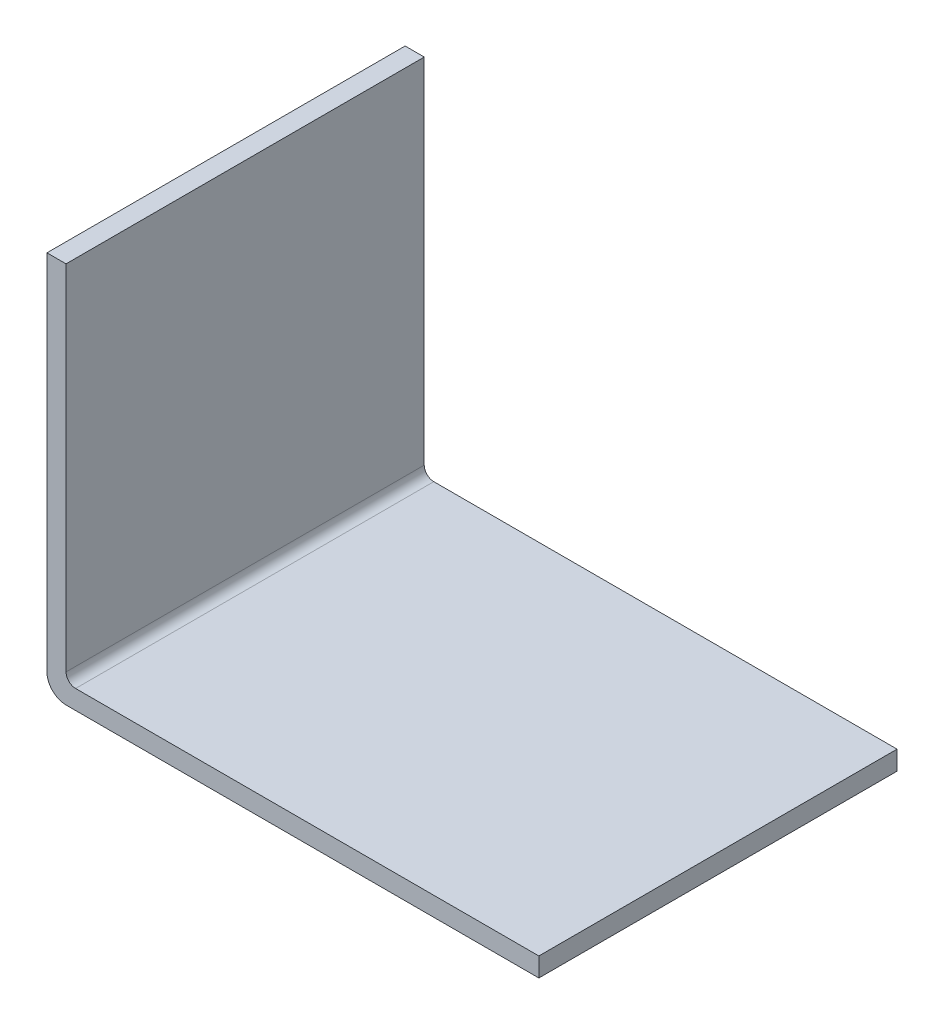
ISO-10303-21;
HEADER;
FILE_DESCRIPTION(('STEP AP214'),'2;1');
FILE_NAME('part.step','',(''),(''),'','','');
FILE_SCHEMA(('AUTOMOTIVE_DESIGN { 1 0 10303 214 1 1 1 1 }'));
ENDSEC;
DATA;
#1=APPLICATION_CONTEXT('core data for automotive mechanical design processes');
#2=APPLICATION_PROTOCOL_DEFINITION('international standard','automotive_design',2000,#1);
#3=PRODUCT_CONTEXT('',#1,'mechanical');
#4=PRODUCT('Part','Part','',(#3));
#5=PRODUCT_RELATED_PRODUCT_CATEGORY('part','',(#4));
#6=PRODUCT_DEFINITION_FORMATION('','',#4);
#7=PRODUCT_DEFINITION_CONTEXT('part definition',#1,'design');
#8=PRODUCT_DEFINITION('design','',#6,#7);
#9=PRODUCT_DEFINITION_SHAPE('','',#8);
#10=(LENGTH_UNIT() NAMED_UNIT(*) SI_UNIT(.MILLI.,.METRE.));
#11=(NAMED_UNIT(*) PLANE_ANGLE_UNIT() SI_UNIT($,.RADIAN.));
#12=(NAMED_UNIT(*) SI_UNIT($,.STERADIAN.) SOLID_ANGLE_UNIT());
#13=UNCERTAINTY_MEASURE_WITH_UNIT(LENGTH_MEASURE(1.E-05),#10,'distance_accuracy_value','');
#14=(GEOMETRIC_REPRESENTATION_CONTEXT(3) GLOBAL_UNCERTAINTY_ASSIGNED_CONTEXT((#13)) GLOBAL_UNIT_ASSIGNED_CONTEXT((#10,
#11,#12)) REPRESENTATION_CONTEXT('',''));
#15=CARTESIAN_POINT('',(0.,0.,0.));
#16=DIRECTION('',(0.,0.,1.));
#17=DIRECTION('',(1.,0.,0.));
#18=AXIS2_PLACEMENT_3D('',#15,#16,#17);
#19=CARTESIAN_POINT('',(25.75,40.,18.75));
#20=DIRECTION('',(-1.,0.,0.));
#21=DIRECTION('',(0.,0.,1.));
#22=AXIS2_PLACEMENT_3D('',#19,#20,#21);
#23=PLANE('',#22);
#24=DIRECTION('',(0.,-1.,0.));
#25=VECTOR('',#24,1.);
#26=CARTESIAN_POINT('',(25.75,40.,-18.75));
#27=LINE('',#26,#25);
#28=CARTESIAN_POINT('',(25.75,2.,-18.75));
#29=VERTEX_POINT('',#28);
#30=CARTESIAN_POINT('',(25.75,0.,-18.75));
#31=VERTEX_POINT('',#30);
#32=EDGE_CURVE('E101',#29,#31,#27,.T.);
#33=ORIENTED_EDGE('',*,*,#32,.F.);
#34=DIRECTION('',(0.,0.,1.));
#35=VECTOR('',#34,1.);
#36=CARTESIAN_POINT('',(25.75,2.,-18.75));
#37=LINE('',#36,#35);
#38=CARTESIAN_POINT('',(25.75,2.,18.75));
#39=VERTEX_POINT('',#38);
#40=EDGE_CURVE('E108',#29,#39,#37,.T.);
#41=ORIENTED_EDGE('',*,*,#40,.T.);
#42=DIRECTION('',(0.,-1.,0.));
#43=VECTOR('',#42,1.);
#44=CARTESIAN_POINT('',(25.75,40.,18.75));
#45=LINE('',#44,#43);
#46=CARTESIAN_POINT('',(25.75,0.,18.75));
#47=VERTEX_POINT('',#46);
#48=EDGE_CURVE('E153',#39,#47,#45,.T.);
#49=ORIENTED_EDGE('',*,*,#48,.T.);
#50=DIRECTION('',(0.,0.,-1.));
#51=VECTOR('',#50,1.);
#52=CARTESIAN_POINT('',(25.75,0.,18.75));
#53=LINE('',#52,#51);
#54=EDGE_CURVE('E122',#47,#31,#53,.T.);
#55=ORIENTED_EDGE('',*,*,#54,.T.);
#56=EDGE_LOOP('',(#33,#41,#49,#55));
#57=FACE_BOUND('',#56,.T.);
#58=ADVANCED_FACE('F34',(#57),#23,.F.);
#59=CARTESIAN_POINT('',(-25.75,40.,-18.75));
#60=DIRECTION('',(0.,0.,1.));
#61=DIRECTION('',(1.,0.,0.));
#62=AXIS2_PLACEMENT_3D('',#59,#60,#61);
#63=PLANE('',#62);
#64=DIRECTION('',(-1.,0.,0.));
#65=VECTOR('',#64,1.);
#66=CARTESIAN_POINT('',(-25.75,0.,-18.75));
#67=LINE('',#66,#65);
#68=CARTESIAN_POINT('',(-23.75,0.,-18.75));
#69=VERTEX_POINT('',#68);
#70=EDGE_CURVE('E159',#31,#69,#67,.T.);
#71=ORIENTED_EDGE('',*,*,#70,.T.);
#72=CARTESIAN_POINT('',(-23.75,2.,-18.75));
#73=DIRECTION('',(0.,0.,1.));
#74=DIRECTION('',(1.,0.,0.));
#75=AXIS2_PLACEMENT_3D('',#72,#73,#74);
#76=CIRCLE('',#75,2.);
#77=CARTESIAN_POINT('',(-25.75,2.,-18.75));
#78=VERTEX_POINT('',#77);
#79=EDGE_CURVE('E11',#69,#78,#76,.F.);
#80=ORIENTED_EDGE('',*,*,#79,.T.);
#81=DIRECTION('',(0.,-1.,0.));
#82=VECTOR('',#81,1.);
#83=CARTESIAN_POINT('',(-25.75,40.,-18.75));
#84=LINE('',#83,#82);
#85=CARTESIAN_POINT('',(-25.75,40.,-18.75));
#86=VERTEX_POINT('',#85);
#87=EDGE_CURVE('E124',#86,#78,#84,.T.);
#88=ORIENTED_EDGE('',*,*,#87,.F.);
#89=DIRECTION('',(-1.,0.,0.));
#90=VECTOR('',#89,1.);
#91=CARTESIAN_POINT('',(-25.75,40.,-18.75));
#92=LINE('',#91,#90);
#93=CARTESIAN_POINT('',(-23.75,40.,-18.75));
#94=VERTEX_POINT('',#93);
#95=EDGE_CURVE('E158',#94,#86,#92,.T.);
#96=ORIENTED_EDGE('',*,*,#95,.F.);
#97=DIRECTION('',(0.,-1.,0.));
#98=VECTOR('',#97,1.);
#99=CARTESIAN_POINT('',(-23.75,2.,-18.75));
#100=LINE('',#99,#98);
#101=CARTESIAN_POINT('',(-23.75,3.,-18.75));
#102=VERTEX_POINT('',#101);
#103=EDGE_CURVE('E109',#94,#102,#100,.T.);
#104=ORIENTED_EDGE('',*,*,#103,.T.);
#105=CARTESIAN_POINT('',(-22.75,3.,-18.75));
#106=DIRECTION('',(0.,0.,1.));
#107=DIRECTION('',(1.,0.,0.));
#108=AXIS2_PLACEMENT_3D('',#105,#106,#107);
#109=CIRCLE('',#108,1.);
#110=CARTESIAN_POINT('',(-22.75,2.,-18.75));
#111=VERTEX_POINT('',#110);
#112=EDGE_CURVE('E104',#102,#111,#109,.T.);
#113=ORIENTED_EDGE('',*,*,#112,.T.);
#114=DIRECTION('',(1.,0.,0.));
#115=VECTOR('',#114,1.);
#116=CARTESIAN_POINT('',(-23.75,2.,-18.75));
#117=LINE('',#116,#115);
#118=EDGE_CURVE('E97',#111,#29,#117,.T.);
#119=ORIENTED_EDGE('',*,*,#118,.T.);
#120=ORIENTED_EDGE('',*,*,#32,.T.);
#121=EDGE_LOOP('',(#71,#80,#88,#96,#104,#113,#119,#120));
#122=FACE_BOUND('',#121,.T.);
#123=ADVANCED_FACE('F99',(#122),#63,.F.);
#124=CARTESIAN_POINT('',(-25.75,40.,18.75));
#125=DIRECTION('',(1.,0.,0.));
#126=DIRECTION('',(0.,0.,-1.));
#127=AXIS2_PLACEMENT_3D('',#124,#125,#126);
#128=PLANE('',#127);
#129=ORIENTED_EDGE('',*,*,#87,.T.);
#130=DIRECTION('',(0.,0.,1.));
#131=VECTOR('',#130,1.);
#132=CARTESIAN_POINT('',(-25.75,2.,18.75));
#133=LINE('',#132,#131);
#134=CARTESIAN_POINT('',(-25.75,2.,18.75));
#135=VERTEX_POINT('',#134);
#136=EDGE_CURVE('E137',#78,#135,#133,.T.);
#137=ORIENTED_EDGE('',*,*,#136,.T.);
#138=DIRECTION('',(0.,-1.,0.));
#139=VECTOR('',#138,1.);
#140=CARTESIAN_POINT('',(-25.75,40.,18.75));
#141=LINE('',#140,#139);
#142=CARTESIAN_POINT('',(-25.75,40.,18.75));
#143=VERTEX_POINT('',#142);
#144=EDGE_CURVE('E129',#143,#135,#141,.T.);
#145=ORIENTED_EDGE('',*,*,#144,.F.);
#146=DIRECTION('',(0.,0.,1.));
#147=VECTOR('',#146,1.);
#148=CARTESIAN_POINT('',(-25.75,40.,18.75));
#149=LINE('',#148,#147);
#150=EDGE_CURVE('E163',#86,#143,#149,.T.);
#151=ORIENTED_EDGE('',*,*,#150,.F.);
#152=EDGE_LOOP('',(#129,#137,#145,#151));
#153=FACE_BOUND('',#152,.T.);
#154=ADVANCED_FACE('F143',(#153),#128,.F.);
#155=CARTESIAN_POINT('',(-25.75,40.,18.75));
#156=DIRECTION('',(0.,0.,-1.));
#157=DIRECTION('',(-1.,0.,0.));
#158=AXIS2_PLACEMENT_3D('',#155,#156,#157);
#159=PLANE('',#158);
#160=ORIENTED_EDGE('',*,*,#144,.T.);
#161=CARTESIAN_POINT('',(-23.75,2.,18.75));
#162=DIRECTION('',(0.,0.,-1.));
#163=DIRECTION('',(-1.,0.,0.));
#164=AXIS2_PLACEMENT_3D('',#161,#162,#163);
#165=CIRCLE('',#164,2.);
#166=CARTESIAN_POINT('',(-23.75,0.,18.75));
#167=VERTEX_POINT('',#166);
#168=EDGE_CURVE('E56',#135,#167,#165,.F.);
#169=ORIENTED_EDGE('',*,*,#168,.T.);
#170=DIRECTION('',(1.,0.,0.));
#171=VECTOR('',#170,1.);
#172=CARTESIAN_POINT('',(-25.75,0.,18.75));
#173=LINE('',#172,#171);
#174=EDGE_CURVE('E156',#167,#47,#173,.T.);
#175=ORIENTED_EDGE('',*,*,#174,.T.);
#176=ORIENTED_EDGE('',*,*,#48,.F.);
#177=DIRECTION('',(1.,0.,0.));
#178=VECTOR('',#177,1.);
#179=CARTESIAN_POINT('',(-23.75,2.,18.75));
#180=LINE('',#179,#178);
#181=CARTESIAN_POINT('',(-22.75,2.,18.75));
#182=VERTEX_POINT('',#181);
#183=EDGE_CURVE('E114',#182,#39,#180,.T.);
#184=ORIENTED_EDGE('',*,*,#183,.F.);
#185=CARTESIAN_POINT('',(-22.75,3.,18.75));
#186=DIRECTION('',(0.,0.,-1.));
#187=DIRECTION('',(-1.,0.,0.));
#188=AXIS2_PLACEMENT_3D('',#185,#186,#187);
#189=CIRCLE('',#188,1.);
#190=CARTESIAN_POINT('',(-23.75,3.,18.75));
#191=VERTEX_POINT('',#190);
#192=EDGE_CURVE('E134',#182,#191,#189,.T.);
#193=ORIENTED_EDGE('',*,*,#192,.T.);
#194=DIRECTION('',(0.,-1.,0.));
#195=VECTOR('',#194,1.);
#196=CARTESIAN_POINT('',(-23.75,2.,18.75));
#197=LINE('',#196,#195);
#198=CARTESIAN_POINT('',(-23.75,40.,18.75));
#199=VERTEX_POINT('',#198);
#200=EDGE_CURVE('E168',#199,#191,#197,.T.);
#201=ORIENTED_EDGE('',*,*,#200,.F.);
#202=DIRECTION('',(1.,0.,0.));
#203=VECTOR('',#202,1.);
#204=CARTESIAN_POINT('',(-25.75,40.,18.75));
#205=LINE('',#204,#203);
#206=EDGE_CURVE('E152',#143,#199,#205,.T.);
#207=ORIENTED_EDGE('',*,*,#206,.F.);
#208=EDGE_LOOP('',(#160,#169,#175,#176,#184,#193,#201,#207));
#209=FACE_BOUND('',#208,.T.);
#210=ADVANCED_FACE('F149',(#209),#159,.F.);
#211=CARTESIAN_POINT('',(0.,40.,0.));
#212=DIRECTION('',(0.,-1.,0.));
#213=DIRECTION('',(0.,0.,-1.));
#214=AXIS2_PLACEMENT_3D('',#211,#212,#213);
#215=PLANE('',#214);
#216=ORIENTED_EDGE('',*,*,#206,.T.);
#217=DIRECTION('',(0.,0.,1.));
#218=VECTOR('',#217,1.);
#219=CARTESIAN_POINT('',(-23.75,40.,-18.75));
#220=LINE('',#219,#218);
#221=EDGE_CURVE('E118',#94,#199,#220,.T.);
#222=ORIENTED_EDGE('',*,*,#221,.F.);
#223=ORIENTED_EDGE('',*,*,#95,.T.);
#224=ORIENTED_EDGE('',*,*,#150,.T.);
#225=EDGE_LOOP('',(#216,#222,#223,#224));
#226=FACE_BOUND('',#225,.T.);
#227=ADVANCED_FACE('F193',(#226),#215,.F.);
#228=CARTESIAN_POINT('',(0.,0.,0.));
#229=DIRECTION('',(0.,-1.,0.));
#230=DIRECTION('',(0.,0.,-1.));
#231=AXIS2_PLACEMENT_3D('',#228,#229,#230);
#232=PLANE('',#231);
#233=ORIENTED_EDGE('',*,*,#174,.F.);
#234=DIRECTION('',(0.,0.,1.));
#235=VECTOR('',#234,1.);
#236=CARTESIAN_POINT('',(-23.75,0.,-18.75));
#237=LINE('',#236,#235);
#238=EDGE_CURVE('E42',#167,#69,#237,.F.);
#239=ORIENTED_EDGE('',*,*,#238,.T.);
#240=ORIENTED_EDGE('',*,*,#70,.F.);
#241=ORIENTED_EDGE('',*,*,#54,.F.);
#242=EDGE_LOOP('',(#233,#239,#240,#241));
#243=FACE_BOUND('',#242,.T.);
#244=ADVANCED_FACE('F177',(#243),#232,.T.);
#245=CARTESIAN_POINT('',(-23.75,2.,-18.75));
#246=DIRECTION('',(-1.,0.,0.));
#247=DIRECTION('',(0.,0.,1.));
#248=AXIS2_PLACEMENT_3D('',#245,#246,#247);
#249=PLANE('',#248);
#250=ORIENTED_EDGE('',*,*,#200,.T.);
#251=DIRECTION('',(0.,0.,1.));
#252=VECTOR('',#251,1.);
#253=CARTESIAN_POINT('',(-23.75,3.,-18.75));
#254=LINE('',#253,#252);
#255=EDGE_CURVE('E126',#191,#102,#254,.F.);
#256=ORIENTED_EDGE('',*,*,#255,.T.);
#257=ORIENTED_EDGE('',*,*,#103,.F.);
#258=ORIENTED_EDGE('',*,*,#221,.T.);
#259=EDGE_LOOP('',(#250,#256,#257,#258));
#260=FACE_BOUND('',#259,.T.);
#261=ADVANCED_FACE('F196',(#260),#249,.F.);
#262=CARTESIAN_POINT('',(-23.75,2.,-18.75));
#263=DIRECTION('',(0.,-1.,0.));
#264=DIRECTION('',(0.,0.,-1.));
#265=AXIS2_PLACEMENT_3D('',#262,#263,#264);
#266=PLANE('',#265);
#267=ORIENTED_EDGE('',*,*,#118,.F.);
#268=DIRECTION('',(0.,0.,1.));
#269=VECTOR('',#268,1.);
#270=CARTESIAN_POINT('',(-22.75,2.,18.75));
#271=LINE('',#270,#269);
#272=EDGE_CURVE('E123',#111,#182,#271,.T.);
#273=ORIENTED_EDGE('',*,*,#272,.T.);
#274=ORIENTED_EDGE('',*,*,#183,.T.);
#275=ORIENTED_EDGE('',*,*,#40,.F.);
#276=EDGE_LOOP('',(#267,#273,#274,#275));
#277=FACE_BOUND('',#276,.T.);
#278=ADVANCED_FACE('F112',(#277),#266,.F.);
#279=CARTESIAN_POINT('',(-22.75,3.,-18.75));
#280=DIRECTION('',(0.,0.,-1.));
#281=DIRECTION('',(-1.,0.,0.));
#282=AXIS2_PLACEMENT_3D('',#279,#280,#281);
#283=CYLINDRICAL_SURFACE('',#282,1.);
#284=ORIENTED_EDGE('',*,*,#112,.F.);
#285=ORIENTED_EDGE('',*,*,#255,.F.);
#286=ORIENTED_EDGE('',*,*,#192,.F.);
#287=ORIENTED_EDGE('',*,*,#272,.F.);
#288=EDGE_LOOP('',(#284,#285,#286,#287));
#289=FACE_BOUND('',#288,.T.);
#290=ADVANCED_FACE('F176',(#289),#283,.F.);
#291=CARTESIAN_POINT('',(-23.75,2.,18.75));
#292=DIRECTION('',(0.,0.,-1.));
#293=DIRECTION('',(-1.,0.,0.));
#294=AXIS2_PLACEMENT_3D('',#291,#292,#293);
#295=CYLINDRICAL_SURFACE('',#294,2.);
#296=ORIENTED_EDGE('',*,*,#79,.F.);
#297=ORIENTED_EDGE('',*,*,#238,.F.);
#298=ORIENTED_EDGE('',*,*,#168,.F.);
#299=ORIENTED_EDGE('',*,*,#136,.F.);
#300=EDGE_LOOP('',(#296,#297,#298,#299));
#301=FACE_BOUND('',#300,.T.);
#302=ADVANCED_FACE('F36',(#301),#295,.T.);
#303=CLOSED_SHELL('',(#58,#123,#154,#210,#227,#244,#261,#278,#290,#302));
#304=MANIFOLD_SOLID_BREP('B2',#303);
#305=ADVANCED_BREP_SHAPE_REPRESENTATION('',(#18,#304),#14);
#306=SHAPE_DEFINITION_REPRESENTATION(#9,#305);
ENDSEC;
END-ISO-10303-21;
